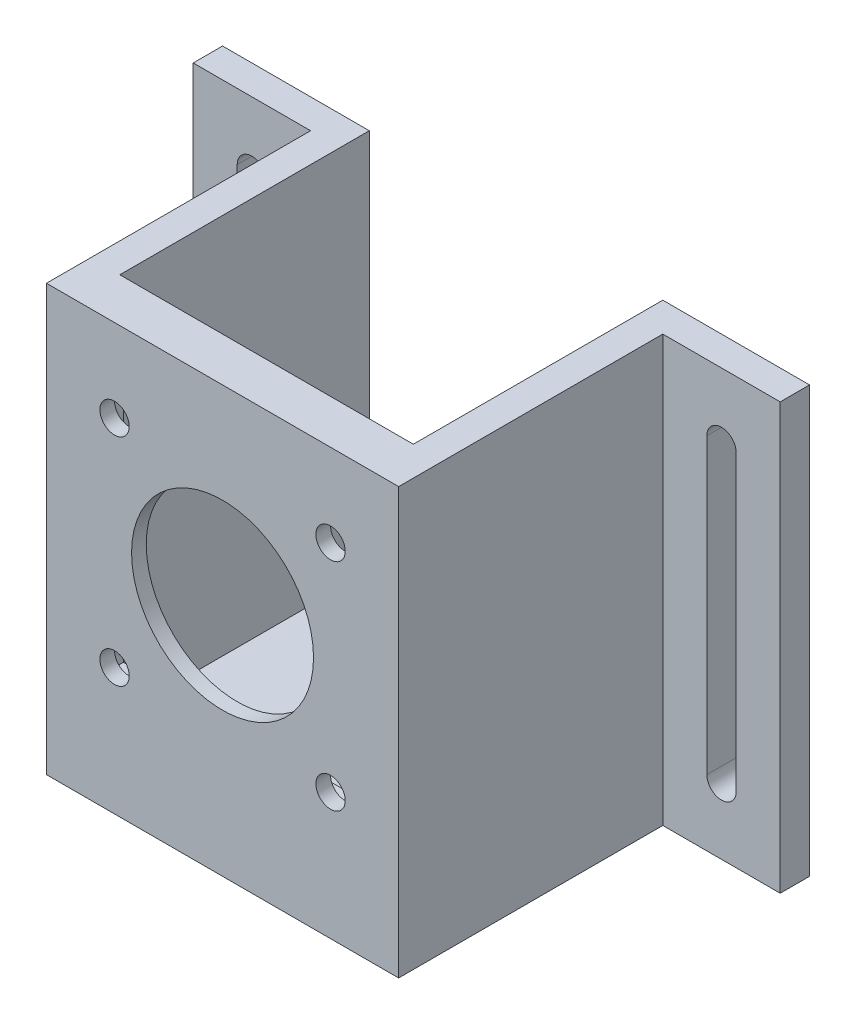
ISO-10303-21;
HEADER;
FILE_DESCRIPTION(('STEP AP214'),'2;1');
FILE_NAME('part.step','',(''),(''),'','','');
FILE_SCHEMA(('AUTOMOTIVE_DESIGN { 1 0 10303 214 1 1 1 1 }'));
ENDSEC;
DATA;
#1=APPLICATION_CONTEXT('core data for automotive mechanical design processes');
#2=APPLICATION_PROTOCOL_DEFINITION('international standard','automotive_design',2000,#1);
#3=PRODUCT_CONTEXT('',#1,'mechanical');
#4=PRODUCT('Part','Part','',(#3));
#5=PRODUCT_RELATED_PRODUCT_CATEGORY('part','',(#4));
#6=PRODUCT_DEFINITION_FORMATION('','',#4);
#7=PRODUCT_DEFINITION_CONTEXT('part definition',#1,'design');
#8=PRODUCT_DEFINITION('design','',#6,#7);
#9=PRODUCT_DEFINITION_SHAPE('','',#8);
#10=(LENGTH_UNIT() NAMED_UNIT(*) SI_UNIT(.MILLI.,.METRE.));
#11=(NAMED_UNIT(*) PLANE_ANGLE_UNIT() SI_UNIT($,.RADIAN.));
#12=(NAMED_UNIT(*) SI_UNIT($,.STERADIAN.) SOLID_ANGLE_UNIT());
#13=UNCERTAINTY_MEASURE_WITH_UNIT(LENGTH_MEASURE(1.E-05),#10,'distance_accuracy_value','');
#14=(GEOMETRIC_REPRESENTATION_CONTEXT(3) GLOBAL_UNCERTAINTY_ASSIGNED_CONTEXT((#13)) GLOBAL_UNIT_ASSIGNED_CONTEXT((#10,
#11,#12)) REPRESENTATION_CONTEXT('',''));
#15=CARTESIAN_POINT('',(0.,0.,0.));
#16=DIRECTION('',(0.,0.,1.));
#17=DIRECTION('',(1.,0.,0.));
#18=AXIS2_PLACEMENT_3D('',#15,#16,#17);
#19=CARTESIAN_POINT('',(76.2,9.525,0.));
#20=DIRECTION('',(-1.,0.,0.));
#21=DIRECTION('',(0.,0.,1.));
#22=AXIS2_PLACEMENT_3D('',#19,#20,#21);
#23=PLANE('',#22);
#24=DIRECTION('',(0.,-1.,0.));
#25=VECTOR('',#24,1.);
#26=CARTESIAN_POINT('',(76.2,0.,-57.15));
#27=LINE('',#26,#25);
#28=CARTESIAN_POINT('',(76.2,92.075,-57.15));
#29=VERTEX_POINT('',#28);
#30=CARTESIAN_POINT('',(76.2,0.,-57.15));
#31=VERTEX_POINT('',#30);
#32=EDGE_CURVE('E250',#29,#31,#27,.T.);
#33=ORIENTED_EDGE('',*,*,#32,.F.);
#34=DIRECTION('',(0.,0.,-1.));
#35=VECTOR('',#34,1.);
#36=CARTESIAN_POINT('',(76.2,92.075,0.));
#37=LINE('',#36,#35);
#38=CARTESIAN_POINT('',(76.2,92.075,0.));
#39=VERTEX_POINT('',#38);
#40=EDGE_CURVE('E470',#39,#29,#37,.T.);
#41=ORIENTED_EDGE('',*,*,#40,.F.);
#42=DIRECTION('',(0.,-1.,0.));
#43=VECTOR('',#42,1.);
#44=CARTESIAN_POINT('',(76.2,9.525,0.));
#45=LINE('',#44,#43);
#46=CARTESIAN_POINT('',(76.2,0.,0.));
#47=VERTEX_POINT('',#46);
#48=EDGE_CURVE('E49',#39,#47,#45,.T.);
#49=ORIENTED_EDGE('',*,*,#48,.T.);
#50=DIRECTION('',(0.,0.,-1.));
#51=VECTOR('',#50,1.);
#52=CARTESIAN_POINT('',(76.2,0.,0.));
#53=LINE('',#52,#51);
#54=EDGE_CURVE('E492',#47,#31,#53,.T.);
#55=ORIENTED_EDGE('',*,*,#54,.T.);
#56=EDGE_LOOP('',(#33,#41,#49,#55));
#57=FACE_BOUND('',#56,.T.);
#58=ADVANCED_FACE('F39',(#57),#23,.F.);
#59=CARTESIAN_POINT('',(0.,9.525,0.));
#60=DIRECTION('',(1.,0.,0.));
#61=DIRECTION('',(0.,0.,-1.));
#62=AXIS2_PLACEMENT_3D('',#59,#60,#61);
#63=PLANE('',#62);
#64=DIRECTION('',(0.,1.,0.));
#65=VECTOR('',#64,1.);
#66=CARTESIAN_POINT('',(0.,92.075,-57.15));
#67=LINE('',#66,#65);
#68=CARTESIAN_POINT('',(0.,0.,-57.15));
#69=VERTEX_POINT('',#68);
#70=CARTESIAN_POINT('',(0.,92.075,-57.15));
#71=VERTEX_POINT('',#70);
#72=EDGE_CURVE('E322',#69,#71,#67,.T.);
#73=ORIENTED_EDGE('',*,*,#72,.F.);
#74=DIRECTION('',(0.,0.,1.));
#75=VECTOR('',#74,1.);
#76=CARTESIAN_POINT('',(0.,0.,0.));
#77=LINE('',#76,#75);
#78=CARTESIAN_POINT('',(0.,0.,0.));
#79=VERTEX_POINT('',#78);
#80=EDGE_CURVE('E478',#69,#79,#77,.T.);
#81=ORIENTED_EDGE('',*,*,#80,.T.);
#82=DIRECTION('',(0.,-1.,0.));
#83=VECTOR('',#82,1.);
#84=CARTESIAN_POINT('',(0.,9.525,0.));
#85=LINE('',#84,#83);
#86=CARTESIAN_POINT('',(0.,92.075,0.));
#87=VERTEX_POINT('',#86);
#88=EDGE_CURVE('E11',#87,#79,#85,.T.);
#89=ORIENTED_EDGE('',*,*,#88,.F.);
#90=DIRECTION('',(0.,0.,1.));
#91=VECTOR('',#90,1.);
#92=CARTESIAN_POINT('',(0.,92.075,0.));
#93=LINE('',#92,#91);
#94=EDGE_CURVE('E463',#71,#87,#93,.T.);
#95=ORIENTED_EDGE('',*,*,#94,.F.);
#96=EDGE_LOOP('',(#73,#81,#89,#95));
#97=FACE_BOUND('',#96,.T.);
#98=ADVANCED_FACE('F41',(#97),#63,.F.);
#99=CARTESIAN_POINT('',(0.,9.525,0.));
#100=DIRECTION('',(0.,-1.,0.));
#101=DIRECTION('',(0.,0.,-1.));
#102=AXIS2_PLACEMENT_3D('',#99,#100,#101);
#103=PLANE('',#102);
#104=DIRECTION('',(0.,0.,-1.));
#105=VECTOR('',#104,1.);
#106=CARTESIAN_POINT('',(6.35,9.525,-9.525));
#107=LINE('',#106,#105);
#108=CARTESIAN_POINT('',(6.35,9.525,-9.525));
#109=VERTEX_POINT('',#108);
#110=CARTESIAN_POINT('',(6.35,9.525,-63.5));
#111=VERTEX_POINT('',#110);
#112=EDGE_CURVE('E348',#109,#111,#107,.T.);
#113=ORIENTED_EDGE('',*,*,#112,.F.);
#114=DIRECTION('',(-1.,0.,0.));
#115=VECTOR('',#114,1.);
#116=CARTESIAN_POINT('',(0.,9.525,-9.525));
#117=LINE('',#116,#115);
#118=CARTESIAN_POINT('',(69.85,9.525,-9.525));
#119=VERTEX_POINT('',#118);
#120=EDGE_CURVE('E462',#119,#109,#117,.T.);
#121=ORIENTED_EDGE('',*,*,#120,.F.);
#122=DIRECTION('',(0.,0.,1.));
#123=VECTOR('',#122,1.);
#124=CARTESIAN_POINT('',(69.85,9.525,-9.525));
#125=LINE('',#124,#123);
#126=CARTESIAN_POINT('',(69.85,9.525,-63.5));
#127=VERTEX_POINT('',#126);
#128=EDGE_CURVE('E352',#127,#119,#125,.T.);
#129=ORIENTED_EDGE('',*,*,#128,.F.);
#130=DIRECTION('',(-1.,0.,0.));
#131=VECTOR('',#130,1.);
#132=CARTESIAN_POINT('',(0.,9.525,-63.5));
#133=LINE('',#132,#131);
#134=EDGE_CURVE('E482',#127,#111,#133,.T.);
#135=ORIENTED_EDGE('',*,*,#134,.T.);
#136=EDGE_LOOP('',(#113,#121,#129,#135));
#137=FACE_BOUND('',#136,.T.);
#138=ADVANCED_FACE('F548',(#137),#103,.F.);
#139=CARTESIAN_POINT('',(0.,92.075,-9.525));
#140=DIRECTION('',(0.,0.,1.));
#141=DIRECTION('',(1.,0.,0.));
#142=AXIS2_PLACEMENT_3D('',#139,#140,#141);
#143=PLANE('',#142);
#144=DIRECTION('',(1.,0.,0.));
#145=VECTOR('',#144,1.);
#146=CARTESIAN_POINT('',(69.0607433991601,81.7422937134878,-9.525));
#147=LINE('',#146,#145);
#148=CARTESIAN_POINT('',(7.13925660083996,81.7422937134878,-9.525));
#149=VERTEX_POINT('',#148);
#150=CARTESIAN_POINT('',(69.0607433991601,81.7422937134878,-9.525));
#151=VERTEX_POINT('',#150);
#152=EDGE_CURVE('E403',#149,#151,#147,.T.);
#153=ORIENTED_EDGE('',*,*,#152,.F.);
#154=DIRECTION('',(0.,1.,0.));
#155=VECTOR('',#154,1.);
#156=CARTESIAN_POINT('',(7.13925660083996,81.7422937134878,-9.525));
#157=LINE('',#156,#155);
#158=CARTESIAN_POINT('',(7.13925660083996,19.8577062865122,-9.525));
#159=VERTEX_POINT('',#158);
#160=EDGE_CURVE('E374',#159,#149,#157,.T.);
#161=ORIENTED_EDGE('',*,*,#160,.F.);
#162=DIRECTION('',(-1.,0.,0.));
#163=VECTOR('',#162,1.);
#164=CARTESIAN_POINT('',(69.06074339916,19.8577062865122,-9.525));
#165=LINE('',#164,#163);
#166=CARTESIAN_POINT('',(69.06074339916,19.8577062865122,-9.525));
#167=VERTEX_POINT('',#166);
#168=EDGE_CURVE('E388',#167,#159,#165,.T.);
#169=ORIENTED_EDGE('',*,*,#168,.F.);
#170=DIRECTION('',(0.,-1.,0.));
#171=VECTOR('',#170,1.);
#172=CARTESIAN_POINT('',(69.0607433991601,81.7422937134878,-9.525));
#173=LINE('',#172,#171);
#174=EDGE_CURVE('E407',#151,#167,#173,.T.);
#175=ORIENTED_EDGE('',*,*,#174,.F.);
#176=EDGE_LOOP('',(#153,#161,#169,#175));
#177=FACE_BOUND('',#176,.T.);
#178=DIRECTION('',(0.,-1.,0.));
#179=VECTOR('',#178,1.);
#180=CARTESIAN_POINT('',(6.35,146.42224579038,-9.525));
#181=LINE('',#180,#179);
#182=CARTESIAN_POINT('',(6.35,92.075,-9.525));
#183=VERTEX_POINT('',#182);
#184=EDGE_CURVE('E360',#183,#109,#181,.T.);
#185=ORIENTED_EDGE('',*,*,#184,.F.);
#186=DIRECTION('',(-1.,0.,0.));
#187=VECTOR('',#186,1.);
#188=CARTESIAN_POINT('',(0.,92.075,-9.525));
#189=LINE('',#188,#187);
#190=CARTESIAN_POINT('',(69.85,92.075,-9.525));
#191=VERTEX_POINT('',#190);
#192=EDGE_CURVE('E474',#191,#183,#189,.T.);
#193=ORIENTED_EDGE('',*,*,#192,.F.);
#194=DIRECTION('',(0.,-1.,0.));
#195=VECTOR('',#194,1.);
#196=CARTESIAN_POINT('',(69.85,146.42224579038,-9.525));
#197=LINE('',#196,#195);
#198=EDGE_CURVE('E377',#191,#119,#197,.T.);
#199=ORIENTED_EDGE('',*,*,#198,.T.);
#200=ORIENTED_EDGE('',*,*,#120,.T.);
#201=EDGE_LOOP('',(#185,#193,#199,#200));
#202=FACE_BOUND('',#201,.T.);
#203=ADVANCED_FACE('F541',(#177,#202),#143,.F.);
#204=CARTESIAN_POINT('',(38.1,50.8,0.));
#205=DIRECTION('',(0.,0.,-1.));
#206=DIRECTION('',(-1.,0.,0.));
#207=AXIS2_PLACEMENT_3D('',#204,#205,#206);
#208=CYLINDRICAL_SURFACE('',#207,19.685);
#209=CARTESIAN_POINT('',(38.1,50.8,0.));
#210=DIRECTION('',(0.,0.,-1.));
#211=DIRECTION('',(-1.,0.,0.));
#212=AXIS2_PLACEMENT_3D('',#209,#210,#211);
#213=CIRCLE('',#212,19.685);
#214=CARTESIAN_POINT('',(18.415,50.8,0.));
#215=VERTEX_POINT('',#214);
#216=EDGE_CURVE('E447',#215,#215,#213,.T.);
#217=ORIENTED_EDGE('',*,*,#216,.F.);
#218=EDGE_LOOP('',(#217));
#219=FACE_BOUND('',#218,.T.);
#220=CARTESIAN_POINT('',(38.1,50.8,-3.175));
#221=DIRECTION('',(0.,0.,-1.));
#222=DIRECTION('',(-1.,0.,0.));
#223=AXIS2_PLACEMENT_3D('',#220,#221,#222);
#224=CIRCLE('',#223,19.685);
#225=CARTESIAN_POINT('',(18.415,50.8,-3.175));
#226=VERTEX_POINT('',#225);
#227=EDGE_CURVE('E438',#226,#226,#224,.F.);
#228=ORIENTED_EDGE('',*,*,#227,.F.);
#229=EDGE_LOOP('',(#228));
#230=FACE_BOUND('',#229,.T.);
#231=ADVANCED_FACE('F590',(#219,#230),#208,.F.);
#232=CARTESIAN_POINT('',(14.732,27.432,0.));
#233=DIRECTION('',(0.,0.,-1.));
#234=DIRECTION('',(-1.,0.,0.));
#235=AXIS2_PLACEMENT_3D('',#232,#233,#234);
#236=CYLINDRICAL_SURFACE('',#235,3.175);
#237=CARTESIAN_POINT('',(14.732,27.432,0.));
#238=DIRECTION('',(0.,0.,-1.));
#239=DIRECTION('',(1.,0.,0.));
#240=AXIS2_PLACEMENT_3D('',#237,#238,#239);
#241=CIRCLE('',#240,3.175);
#242=CARTESIAN_POINT('',(17.907,27.432,0.));
#243=VERTEX_POINT('',#242);
#244=EDGE_CURVE('E443',#243,#243,#241,.T.);
#245=ORIENTED_EDGE('',*,*,#244,.F.);
#246=EDGE_LOOP('',(#245));
#247=FACE_BOUND('',#246,.T.);
#248=CARTESIAN_POINT('',(14.732,27.432,-3.175));
#249=DIRECTION('',(0.,0.,-1.));
#250=DIRECTION('',(-1.,0.,0.));
#251=AXIS2_PLACEMENT_3D('',#248,#249,#250);
#252=CIRCLE('',#251,3.175);
#253=CARTESIAN_POINT('',(11.557,27.432,-3.175));
#254=VERTEX_POINT('',#253);
#255=EDGE_CURVE('E434',#254,#254,#252,.F.);
#256=ORIENTED_EDGE('',*,*,#255,.F.);
#257=EDGE_LOOP('',(#256));
#258=FACE_BOUND('',#257,.T.);
#259=ADVANCED_FACE('F593',(#247,#258),#236,.F.);
#260=CARTESIAN_POINT('',(61.468,27.432,0.));
#261=DIRECTION('',(0.,0.,-1.));
#262=DIRECTION('',(-1.,0.,0.));
#263=AXIS2_PLACEMENT_3D('',#260,#261,#262);
#264=CYLINDRICAL_SURFACE('',#263,3.175);
#265=CARTESIAN_POINT('',(61.468,27.432,0.));
#266=DIRECTION('',(0.,0.,-1.));
#267=DIRECTION('',(1.,0.,0.));
#268=AXIS2_PLACEMENT_3D('',#265,#266,#267);
#269=CIRCLE('',#268,3.175);
#270=CARTESIAN_POINT('',(64.643,27.432,0.));
#271=VERTEX_POINT('',#270);
#272=EDGE_CURVE('E448',#271,#271,#269,.T.);
#273=ORIENTED_EDGE('',*,*,#272,.F.);
#274=EDGE_LOOP('',(#273));
#275=FACE_BOUND('',#274,.T.);
#276=CARTESIAN_POINT('',(61.468,27.432,-3.175));
#277=DIRECTION('',(0.,0.,-1.));
#278=DIRECTION('',(-1.,0.,0.));
#279=AXIS2_PLACEMENT_3D('',#276,#277,#278);
#280=CIRCLE('',#279,3.175);
#281=CARTESIAN_POINT('',(58.293,27.432,-3.175));
#282=VERTEX_POINT('',#281);
#283=EDGE_CURVE('E430',#282,#282,#280,.F.);
#284=ORIENTED_EDGE('',*,*,#283,.F.);
#285=EDGE_LOOP('',(#284));
#286=FACE_BOUND('',#285,.T.);
#287=ADVANCED_FACE('F619',(#275,#286),#264,.F.);
#288=CARTESIAN_POINT('',(61.468,74.168,0.));
#289=DIRECTION('',(0.,0.,-1.));
#290=DIRECTION('',(-1.,0.,0.));
#291=AXIS2_PLACEMENT_3D('',#288,#289,#290);
#292=CYLINDRICAL_SURFACE('',#291,3.175);
#293=CARTESIAN_POINT('',(61.468,74.168,0.));
#294=DIRECTION('',(0.,0.,-1.));
#295=DIRECTION('',(-1.,0.,0.));
#296=AXIS2_PLACEMENT_3D('',#293,#294,#295);
#297=CIRCLE('',#296,3.175);
#298=CARTESIAN_POINT('',(58.293,74.168,0.));
#299=VERTEX_POINT('',#298);
#300=EDGE_CURVE('E452',#299,#299,#297,.T.);
#301=ORIENTED_EDGE('',*,*,#300,.F.);
#302=EDGE_LOOP('',(#301));
#303=FACE_BOUND('',#302,.T.);
#304=CARTESIAN_POINT('',(61.468,74.168,-3.175));
#305=DIRECTION('',(0.,0.,-1.));
#306=DIRECTION('',(-1.,0.,0.));
#307=AXIS2_PLACEMENT_3D('',#304,#305,#306);
#308=CIRCLE('',#307,3.175);
#309=CARTESIAN_POINT('',(58.293,74.168,-3.175));
#310=VERTEX_POINT('',#309);
#311=EDGE_CURVE('E426',#310,#310,#308,.F.);
#312=ORIENTED_EDGE('',*,*,#311,.F.);
#313=EDGE_LOOP('',(#312));
#314=FACE_BOUND('',#313,.T.);
#315=ADVANCED_FACE('F577',(#303,#314),#292,.F.);
#316=CARTESIAN_POINT('',(14.732,74.168,0.));
#317=DIRECTION('',(0.,0.,-1.));
#318=DIRECTION('',(-1.,0.,0.));
#319=AXIS2_PLACEMENT_3D('',#316,#317,#318);
#320=CYLINDRICAL_SURFACE('',#319,3.175);
#321=CARTESIAN_POINT('',(14.732,74.168,0.));
#322=DIRECTION('',(0.,0.,-1.));
#323=DIRECTION('',(-1.,0.,0.));
#324=AXIS2_PLACEMENT_3D('',#321,#322,#323);
#325=CIRCLE('',#324,3.175);
#326=CARTESIAN_POINT('',(11.557,74.168,0.));
#327=VERTEX_POINT('',#326);
#328=EDGE_CURVE('E442',#327,#327,#325,.T.);
#329=ORIENTED_EDGE('',*,*,#328,.F.);
#330=EDGE_LOOP('',(#329));
#331=FACE_BOUND('',#330,.T.);
#332=CARTESIAN_POINT('',(14.732,74.168,-3.175));
#333=DIRECTION('',(0.,0.,-1.));
#334=DIRECTION('',(-1.,0.,0.));
#335=AXIS2_PLACEMENT_3D('',#332,#333,#334);
#336=CIRCLE('',#335,3.175);
#337=CARTESIAN_POINT('',(11.557,74.168,-3.175));
#338=VERTEX_POINT('',#337);
#339=EDGE_CURVE('E43',#338,#338,#336,.F.);
#340=ORIENTED_EDGE('',*,*,#339,.F.);
#341=EDGE_LOOP('',(#340));
#342=FACE_BOUND('',#341,.T.);
#343=ADVANCED_FACE('F571',(#331,#342),#320,.F.);
#344=CARTESIAN_POINT('',(0.,9.525,0.));
#345=DIRECTION('',(0.,0.,-1.));
#346=DIRECTION('',(-1.,0.,0.));
#347=AXIS2_PLACEMENT_3D('',#344,#345,#346);
#348=PLANE('',#347);
#349=ORIENTED_EDGE('',*,*,#328,.T.);
#350=EDGE_LOOP('',(#349));
#351=FACE_BOUND('',#350,.T.);
#352=ORIENTED_EDGE('',*,*,#300,.T.);
#353=EDGE_LOOP('',(#352));
#354=FACE_BOUND('',#353,.T.);
#355=ORIENTED_EDGE('',*,*,#272,.T.);
#356=EDGE_LOOP('',(#355));
#357=FACE_BOUND('',#356,.T.);
#358=ORIENTED_EDGE('',*,*,#244,.T.);
#359=EDGE_LOOP('',(#358));
#360=FACE_BOUND('',#359,.T.);
#361=ORIENTED_EDGE('',*,*,#216,.T.);
#362=EDGE_LOOP('',(#361));
#363=FACE_BOUND('',#362,.T.);
#364=DIRECTION('',(1.,0.,0.));
#365=VECTOR('',#364,1.);
#366=CARTESIAN_POINT('',(0.,0.,0.));
#367=LINE('',#366,#365);
#368=EDGE_CURVE('E489',#79,#47,#367,.T.);
#369=ORIENTED_EDGE('',*,*,#368,.T.);
#370=ORIENTED_EDGE('',*,*,#48,.F.);
#371=DIRECTION('',(1.,0.,0.));
#372=VECTOR('',#371,1.);
#373=CARTESIAN_POINT('',(0.,92.075,0.));
#374=LINE('',#373,#372);
#375=EDGE_CURVE('E466',#87,#39,#374,.T.);
#376=ORIENTED_EDGE('',*,*,#375,.F.);
#377=ORIENTED_EDGE('',*,*,#88,.T.);
#378=EDGE_LOOP('',(#369,#370,#376,#377));
#379=FACE_BOUND('',#378,.T.);
#380=ADVANCED_FACE('F518',(#351,#354,#357,#360,#363,#379),#348,.F.);
#381=CARTESIAN_POINT('',(0.,9.525,-63.5));
#382=DIRECTION('',(0.,0.,1.));
#383=DIRECTION('',(1.,0.,0.));
#384=AXIS2_PLACEMENT_3D('',#381,#382,#383);
#385=PLANE('',#384);
#386=DIRECTION('',(0.,1.,0.));
#387=VECTOR('',#386,1.);
#388=CARTESIAN_POINT('',(-9.525,77.7875,-63.5));
#389=LINE('',#388,#387);
#390=CARTESIAN_POINT('',(-9.525,14.2875,-63.5));
#391=VERTEX_POINT('',#390);
#392=CARTESIAN_POINT('',(-9.525,77.7875,-63.5));
#393=VERTEX_POINT('',#392);
#394=EDGE_CURVE('E215',#391,#393,#389,.T.);
#395=ORIENTED_EDGE('',*,*,#394,.T.);
#396=CARTESIAN_POINT('',(-12.7,77.7875,-63.5));
#397=DIRECTION('',(0.,0.,1.));
#398=DIRECTION('',(1.,0.,0.));
#399=AXIS2_PLACEMENT_3D('',#396,#397,#398);
#400=CIRCLE('',#399,3.175);
#401=CARTESIAN_POINT('',(-15.875,77.7875,-63.5));
#402=VERTEX_POINT('',#401);
#403=EDGE_CURVE('E206',#393,#402,#400,.T.);
#404=ORIENTED_EDGE('',*,*,#403,.T.);
#405=DIRECTION('',(0.,-1.,0.));
#406=VECTOR('',#405,1.);
#407=CARTESIAN_POINT('',(-15.875,77.7875,-63.5));
#408=LINE('',#407,#406);
#409=CARTESIAN_POINT('',(-15.875,14.2875,-63.5));
#410=VERTEX_POINT('',#409);
#411=EDGE_CURVE('E218',#402,#410,#408,.T.);
#412=ORIENTED_EDGE('',*,*,#411,.T.);
#413=CARTESIAN_POINT('',(-12.7,14.2875,-63.5));
#414=DIRECTION('',(0.,0.,1.));
#415=DIRECTION('',(1.,0.,0.));
#416=AXIS2_PLACEMENT_3D('',#413,#414,#415);
#417=CIRCLE('',#416,3.175);
#418=EDGE_CURVE('E56',#410,#391,#417,.T.);
#419=ORIENTED_EDGE('',*,*,#418,.T.);
#420=EDGE_LOOP('',(#395,#404,#412,#419));
#421=FACE_BOUND('',#420,.T.);
#422=DIRECTION('',(0.,-1.,0.));
#423=VECTOR('',#422,1.);
#424=CARTESIAN_POINT('',(85.725,14.2875,-63.5));
#425=LINE('',#424,#423);
#426=CARTESIAN_POINT('',(85.725,77.7875,-63.5));
#427=VERTEX_POINT('',#426);
#428=CARTESIAN_POINT('',(85.725,14.2875,-63.5));
#429=VERTEX_POINT('',#428);
#430=EDGE_CURVE('E267',#427,#429,#425,.T.);
#431=ORIENTED_EDGE('',*,*,#430,.T.);
#432=CARTESIAN_POINT('',(88.9,14.2875,-63.5));
#433=DIRECTION('',(0.,0.,1.));
#434=DIRECTION('',(-1.,0.,0.));
#435=AXIS2_PLACEMENT_3D('',#432,#433,#434);
#436=CIRCLE('',#435,3.175);
#437=CARTESIAN_POINT('',(92.075,14.2875,-63.5));
#438=VERTEX_POINT('',#437);
#439=EDGE_CURVE('E256',#429,#438,#436,.T.);
#440=ORIENTED_EDGE('',*,*,#439,.T.);
#441=DIRECTION('',(0.,1.,0.));
#442=VECTOR('',#441,1.);
#443=CARTESIAN_POINT('',(92.075,77.7875,-63.5));
#444=LINE('',#443,#442);
#445=CARTESIAN_POINT('',(92.075,77.7875,-63.5));
#446=VERTEX_POINT('',#445);
#447=EDGE_CURVE('E260',#438,#446,#444,.T.);
#448=ORIENTED_EDGE('',*,*,#447,.T.);
#449=CARTESIAN_POINT('',(88.9,77.7875,-63.5));
#450=DIRECTION('',(0.,0.,1.));
#451=DIRECTION('',(1.,0.,0.));
#452=AXIS2_PLACEMENT_3D('',#449,#450,#451);
#453=CIRCLE('',#452,3.175);
#454=EDGE_CURVE('E64',#446,#427,#453,.T.);
#455=ORIENTED_EDGE('',*,*,#454,.T.);
#456=EDGE_LOOP('',(#431,#440,#448,#455));
#457=FACE_BOUND('',#456,.T.);
#458=DIRECTION('',(-1.,0.,0.));
#459=VECTOR('',#458,1.);
#460=CARTESIAN_POINT('',(0.,0.,-63.5));
#461=LINE('',#460,#459);
#462=CARTESIAN_POINT('',(101.6,0.,-63.5));
#463=VERTEX_POINT('',#462);
#464=CARTESIAN_POINT('',(-25.4,0.,-63.5));
#465=VERTEX_POINT('',#464);
#466=EDGE_CURVE('E486',#463,#465,#461,.T.);
#467=ORIENTED_EDGE('',*,*,#466,.T.);
#468=DIRECTION('',(0.,-1.,0.));
#469=VECTOR('',#468,1.);
#470=CARTESIAN_POINT('',(-25.4,92.075,-63.5));
#471=LINE('',#470,#469);
#472=CARTESIAN_POINT('',(-25.4,92.075,-63.5));
#473=VERTEX_POINT('',#472);
#474=EDGE_CURVE('E323',#473,#465,#471,.T.);
#475=ORIENTED_EDGE('',*,*,#474,.F.);
#476=DIRECTION('',(1.,0.,0.));
#477=VECTOR('',#476,1.);
#478=CARTESIAN_POINT('',(0.,92.075,-63.5));
#479=LINE('',#478,#477);
#480=CARTESIAN_POINT('',(6.35,92.075,-63.5));
#481=VERTEX_POINT('',#480);
#482=EDGE_CURVE('E353',#473,#481,#479,.T.);
#483=ORIENTED_EDGE('',*,*,#482,.T.);
#484=DIRECTION('',(0.,-1.,0.));
#485=VECTOR('',#484,1.);
#486=CARTESIAN_POINT('',(6.35,146.42224579038,-63.5));
#487=LINE('',#486,#485);
#488=EDGE_CURVE('E357',#481,#111,#487,.T.);
#489=ORIENTED_EDGE('',*,*,#488,.T.);
#490=ORIENTED_EDGE('',*,*,#134,.F.);
#491=DIRECTION('',(0.,-1.,0.));
#492=VECTOR('',#491,1.);
#493=CARTESIAN_POINT('',(69.85,146.42224579038,-63.5));
#494=LINE('',#493,#492);
#495=CARTESIAN_POINT('',(69.85,92.075,-63.5));
#496=VERTEX_POINT('',#495);
#497=EDGE_CURVE('E371',#496,#127,#494,.T.);
#498=ORIENTED_EDGE('',*,*,#497,.F.);
#499=DIRECTION('',(1.,0.,0.));
#500=VECTOR('',#499,1.);
#501=CARTESIAN_POINT('',(76.2,92.075,-63.5));
#502=LINE('',#501,#500);
#503=CARTESIAN_POINT('',(101.6,92.075,-63.5));
#504=VERTEX_POINT('',#503);
#505=EDGE_CURVE('E370',#496,#504,#502,.T.);
#506=ORIENTED_EDGE('',*,*,#505,.T.);
#507=DIRECTION('',(0.,1.,0.));
#508=VECTOR('',#507,1.);
#509=CARTESIAN_POINT('',(101.6,0.,-63.5));
#510=LINE('',#509,#508);
#511=EDGE_CURVE('E297',#463,#504,#510,.T.);
#512=ORIENTED_EDGE('',*,*,#511,.F.);
#513=EDGE_LOOP('',(#467,#475,#483,#489,#490,#498,#506,#512));
#514=FACE_BOUND('',#513,.T.);
#515=ADVANCED_FACE('F223',(#421,#457,#514),#385,.F.);
#516=CARTESIAN_POINT('',(0.,0.,0.));
#517=DIRECTION('',(0.,-1.,0.));
#518=DIRECTION('',(0.,0.,-1.));
#519=AXIS2_PLACEMENT_3D('',#516,#517,#518);
#520=PLANE('',#519);
#521=ORIENTED_EDGE('',*,*,#80,.F.);
#522=DIRECTION('',(1.,0.,0.));
#523=VECTOR('',#522,1.);
#524=CARTESIAN_POINT('',(-25.4,0.,-57.15));
#525=LINE('',#524,#523);
#526=CARTESIAN_POINT('',(-25.4,0.,-57.15));
#527=VERTEX_POINT('',#526);
#528=EDGE_CURVE('E344',#527,#69,#525,.T.);
#529=ORIENTED_EDGE('',*,*,#528,.F.);
#530=DIRECTION('',(0.,0.,1.));
#531=VECTOR('',#530,1.);
#532=CARTESIAN_POINT('',(-25.4,0.,-63.5));
#533=LINE('',#532,#531);
#534=EDGE_CURVE('E327',#465,#527,#533,.T.);
#535=ORIENTED_EDGE('',*,*,#534,.F.);
#536=ORIENTED_EDGE('',*,*,#466,.F.);
#537=DIRECTION('',(0.,0.,-1.));
#538=VECTOR('',#537,1.);
#539=CARTESIAN_POINT('',(101.6,0.,-63.5));
#540=LINE('',#539,#538);
#541=CARTESIAN_POINT('',(101.6,0.,-57.15));
#542=VERTEX_POINT('',#541);
#543=EDGE_CURVE('E307',#542,#463,#540,.T.);
#544=ORIENTED_EDGE('',*,*,#543,.F.);
#545=DIRECTION('',(-1.,0.,0.));
#546=VECTOR('',#545,1.);
#547=CARTESIAN_POINT('',(101.6,0.,-57.15));
#548=LINE('',#547,#546);
#549=EDGE_CURVE('E311',#542,#31,#548,.T.);
#550=ORIENTED_EDGE('',*,*,#549,.T.);
#551=ORIENTED_EDGE('',*,*,#54,.F.);
#552=ORIENTED_EDGE('',*,*,#368,.F.);
#553=EDGE_LOOP('',(#521,#529,#535,#536,#544,#550,#551,#552));
#554=FACE_BOUND('',#553,.T.);
#555=ADVANCED_FACE('F507',(#554),#520,.T.);
#556=CARTESIAN_POINT('',(0.,92.075,0.));
#557=DIRECTION('',(0.,-1.,0.));
#558=DIRECTION('',(0.,0.,-1.));
#559=AXIS2_PLACEMENT_3D('',#556,#557,#558);
#560=PLANE('',#559);
#561=ORIENTED_EDGE('',*,*,#482,.F.);
#562=DIRECTION('',(0.,0.,-1.));
#563=VECTOR('',#562,1.);
#564=CARTESIAN_POINT('',(-25.4,92.075,-63.5));
#565=LINE('',#564,#563);
#566=CARTESIAN_POINT('',(-25.4,92.075,-57.15));
#567=VERTEX_POINT('',#566);
#568=EDGE_CURVE('E333',#567,#473,#565,.T.);
#569=ORIENTED_EDGE('',*,*,#568,.F.);
#570=DIRECTION('',(1.,0.,0.));
#571=VECTOR('',#570,1.);
#572=CARTESIAN_POINT('',(-25.4,92.075,-57.15));
#573=LINE('',#572,#571);
#574=EDGE_CURVE('E337',#567,#71,#573,.T.);
#575=ORIENTED_EDGE('',*,*,#574,.T.);
#576=ORIENTED_EDGE('',*,*,#94,.T.);
#577=ORIENTED_EDGE('',*,*,#375,.T.);
#578=ORIENTED_EDGE('',*,*,#40,.T.);
#579=DIRECTION('',(-1.,0.,0.));
#580=VECTOR('',#579,1.);
#581=CARTESIAN_POINT('',(101.6,92.075,-57.15));
#582=LINE('',#581,#580);
#583=CARTESIAN_POINT('',(101.6,92.075,-57.15));
#584=VERTEX_POINT('',#583);
#585=EDGE_CURVE('E318',#584,#29,#582,.T.);
#586=ORIENTED_EDGE('',*,*,#585,.F.);
#587=DIRECTION('',(0.,0.,1.));
#588=VECTOR('',#587,1.);
#589=CARTESIAN_POINT('',(101.6,92.075,-63.5));
#590=LINE('',#589,#588);
#591=EDGE_CURVE('E301',#504,#584,#590,.T.);
#592=ORIENTED_EDGE('',*,*,#591,.F.);
#593=ORIENTED_EDGE('',*,*,#505,.F.);
#594=DIRECTION('',(0.,0.,-1.));
#595=VECTOR('',#594,1.);
#596=CARTESIAN_POINT('',(69.85,92.075,-9.525));
#597=LINE('',#596,#595);
#598=EDGE_CURVE('E366',#191,#496,#597,.T.);
#599=ORIENTED_EDGE('',*,*,#598,.F.);
#600=ORIENTED_EDGE('',*,*,#192,.T.);
#601=DIRECTION('',(0.,0.,1.));
#602=VECTOR('',#601,1.);
#603=CARTESIAN_POINT('',(6.35,92.075,-9.525));
#604=LINE('',#603,#602);
#605=EDGE_CURVE('E349',#481,#183,#604,.T.);
#606=ORIENTED_EDGE('',*,*,#605,.F.);
#607=EDGE_LOOP('',(#561,#569,#575,#576,#577,#578,#586,#592,#593,#599,#600,#606));
#608=FACE_BOUND('',#607,.T.);
#609=ADVANCED_FACE('F515',(#608),#560,.F.);
#610=CARTESIAN_POINT('',(0.,0.,-3.175));
#611=DIRECTION('',(0.,0.,-1.));
#612=DIRECTION('',(-1.,0.,0.));
#613=AXIS2_PLACEMENT_3D('',#610,#611,#612);
#614=PLANE('',#613);
#615=DIRECTION('',(0.,1.,0.));
#616=VECTOR('',#615,1.);
#617=CARTESIAN_POINT('',(7.13925660083996,81.7422937134878,-3.175));
#618=LINE('',#617,#616);
#619=CARTESIAN_POINT('',(7.13925660083996,19.8577062865122,-3.175));
#620=VERTEX_POINT('',#619);
#621=CARTESIAN_POINT('',(7.13925660083996,81.7422937134878,-3.175));
#622=VERTEX_POINT('',#621);
#623=EDGE_CURVE('E383',#620,#622,#618,.T.);
#624=ORIENTED_EDGE('',*,*,#623,.T.);
#625=DIRECTION('',(1.,0.,0.));
#626=VECTOR('',#625,1.);
#627=CARTESIAN_POINT('',(69.0607433991601,81.7422937134878,-3.175));
#628=LINE('',#627,#626);
#629=CARTESIAN_POINT('',(69.0607433991601,81.7422937134878,-3.175));
#630=VERTEX_POINT('',#629);
#631=EDGE_CURVE('E387',#622,#630,#628,.T.);
#632=ORIENTED_EDGE('',*,*,#631,.T.);
#633=DIRECTION('',(0.,-1.,0.));
#634=VECTOR('',#633,1.);
#635=CARTESIAN_POINT('',(69.0607433991601,81.7422937134878,-3.175));
#636=LINE('',#635,#634);
#637=CARTESIAN_POINT('',(69.06074339916,19.8577062865122,-3.175));
#638=VERTEX_POINT('',#637);
#639=EDGE_CURVE('E392',#630,#638,#636,.T.);
#640=ORIENTED_EDGE('',*,*,#639,.T.);
#641=DIRECTION('',(-1.,0.,0.));
#642=VECTOR('',#641,1.);
#643=CARTESIAN_POINT('',(69.06074339916,19.8577062865122,-3.175));
#644=LINE('',#643,#642);
#645=EDGE_CURVE('E396',#638,#620,#644,.T.);
#646=ORIENTED_EDGE('',*,*,#645,.T.);
#647=EDGE_LOOP('',(#624,#632,#640,#646));
#648=FACE_BOUND('',#647,.T.);
#649=ORIENTED_EDGE('',*,*,#339,.T.);
#650=EDGE_LOOP('',(#649));
#651=FACE_BOUND('',#650,.T.);
#652=ORIENTED_EDGE('',*,*,#311,.T.);
#653=EDGE_LOOP('',(#652));
#654=FACE_BOUND('',#653,.T.);
#655=ORIENTED_EDGE('',*,*,#283,.T.);
#656=EDGE_LOOP('',(#655));
#657=FACE_BOUND('',#656,.T.);
#658=ORIENTED_EDGE('',*,*,#255,.T.);
#659=EDGE_LOOP('',(#658));
#660=FACE_BOUND('',#659,.T.);
#661=ORIENTED_EDGE('',*,*,#227,.T.);
#662=EDGE_LOOP('',(#661));
#663=FACE_BOUND('',#662,.T.);
#664=ADVANCED_FACE('F597',(#648,#651,#654,#657,#660,#663),#614,.T.);
#665=CARTESIAN_POINT('',(7.13925660083996,81.7422937134878,-3.175));
#666=DIRECTION('',(-1.,0.,0.));
#667=DIRECTION('',(0.,-1.,0.));
#668=AXIS2_PLACEMENT_3D('',#665,#666,#667);
#669=PLANE('',#668);
#670=ORIENTED_EDGE('',*,*,#160,.T.);
#671=DIRECTION('',(0.,0.,-1.));
#672=VECTOR('',#671,1.);
#673=CARTESIAN_POINT('',(7.13925660083996,81.7422937134878,-3.175));
#674=LINE('',#673,#672);
#675=EDGE_CURVE('E400',#622,#149,#674,.T.);
#676=ORIENTED_EDGE('',*,*,#675,.F.);
#677=ORIENTED_EDGE('',*,*,#623,.F.);
#678=DIRECTION('',(0.,0.,-1.));
#679=VECTOR('',#678,1.);
#680=CARTESIAN_POINT('',(7.13925660083996,19.8577062865122,-3.175));
#681=LINE('',#680,#679);
#682=EDGE_CURVE('E414',#620,#159,#681,.T.);
#683=ORIENTED_EDGE('',*,*,#682,.T.);
#684=EDGE_LOOP('',(#670,#676,#677,#683));
#685=FACE_BOUND('',#684,.T.);
#686=ADVANCED_FACE('F599',(#685),#669,.F.);
#687=CARTESIAN_POINT('',(69.06074339916,19.8577062865122,-3.175));
#688=DIRECTION('',(0.,-1.,0.));
#689=DIRECTION('',(0.,0.,-1.));
#690=AXIS2_PLACEMENT_3D('',#687,#688,#689);
#691=PLANE('',#690);
#692=ORIENTED_EDGE('',*,*,#168,.T.);
#693=ORIENTED_EDGE('',*,*,#682,.F.);
#694=ORIENTED_EDGE('',*,*,#645,.F.);
#695=DIRECTION('',(0.,0.,-1.));
#696=VECTOR('',#695,1.);
#697=CARTESIAN_POINT('',(69.06074339916,19.8577062865122,-3.175));
#698=LINE('',#697,#696);
#699=EDGE_CURVE('E417',#638,#167,#698,.T.);
#700=ORIENTED_EDGE('',*,*,#699,.T.);
#701=EDGE_LOOP('',(#692,#693,#694,#700));
#702=FACE_BOUND('',#701,.T.);
#703=ADVANCED_FACE('F605',(#702),#691,.F.);
#704=CARTESIAN_POINT('',(69.0607433991601,81.7422937134878,-3.175));
#705=DIRECTION('',(1.,0.,0.));
#706=DIRECTION('',(0.,1.,0.));
#707=AXIS2_PLACEMENT_3D('',#704,#705,#706);
#708=PLANE('',#707);
#709=ORIENTED_EDGE('',*,*,#174,.T.);
#710=ORIENTED_EDGE('',*,*,#699,.F.);
#711=ORIENTED_EDGE('',*,*,#639,.F.);
#712=DIRECTION('',(0.,0.,-1.));
#713=VECTOR('',#712,1.);
#714=CARTESIAN_POINT('',(69.0607433991601,81.7422937134878,-3.175));
#715=LINE('',#714,#713);
#716=EDGE_CURVE('E420',#630,#151,#715,.T.);
#717=ORIENTED_EDGE('',*,*,#716,.T.);
#718=EDGE_LOOP('',(#709,#710,#711,#717));
#719=FACE_BOUND('',#718,.T.);
#720=ADVANCED_FACE('F559',(#719),#708,.F.);
#721=CARTESIAN_POINT('',(69.0607433991601,81.7422937134878,-3.175));
#722=DIRECTION('',(0.,1.,0.));
#723=DIRECTION('',(0.,0.,1.));
#724=AXIS2_PLACEMENT_3D('',#721,#722,#723);
#725=PLANE('',#724);
#726=ORIENTED_EDGE('',*,*,#152,.T.);
#727=ORIENTED_EDGE('',*,*,#716,.F.);
#728=ORIENTED_EDGE('',*,*,#631,.F.);
#729=ORIENTED_EDGE('',*,*,#675,.T.);
#730=EDGE_LOOP('',(#726,#727,#728,#729));
#731=FACE_BOUND('',#730,.T.);
#732=ADVANCED_FACE('F552',(#731),#725,.F.);
#733=CARTESIAN_POINT('',(69.85,146.42224579038,-9.525));
#734=DIRECTION('',(1.,0.,0.));
#735=DIRECTION('',(0.,0.,-1.));
#736=AXIS2_PLACEMENT_3D('',#733,#734,#735);
#737=PLANE('',#736);
#738=ORIENTED_EDGE('',*,*,#198,.F.);
#739=ORIENTED_EDGE('',*,*,#598,.T.);
#740=ORIENTED_EDGE('',*,*,#497,.T.);
#741=ORIENTED_EDGE('',*,*,#128,.T.);
#742=EDGE_LOOP('',(#738,#739,#740,#741));
#743=FACE_BOUND('',#742,.T.);
#744=ADVANCED_FACE('F550',(#743),#737,.F.);
#745=CARTESIAN_POINT('',(6.35,146.42224579038,-9.525));
#746=DIRECTION('',(-1.,0.,0.));
#747=DIRECTION('',(0.,0.,1.));
#748=AXIS2_PLACEMENT_3D('',#745,#746,#747);
#749=PLANE('',#748);
#750=ORIENTED_EDGE('',*,*,#488,.F.);
#751=ORIENTED_EDGE('',*,*,#605,.T.);
#752=ORIENTED_EDGE('',*,*,#184,.T.);
#753=ORIENTED_EDGE('',*,*,#112,.T.);
#754=EDGE_LOOP('',(#750,#751,#752,#753));
#755=FACE_BOUND('',#754,.T.);
#756=ADVANCED_FACE('F546',(#755),#749,.F.);
#757=CARTESIAN_POINT('',(-25.4,92.075,-57.15));
#758=DIRECTION('',(0.,0.,-1.));
#759=DIRECTION('',(0.,1.,0.));
#760=AXIS2_PLACEMENT_3D('',#757,#758,#759);
#761=PLANE('',#760);
#762=DIRECTION('',(0.,-1.,0.));
#763=VECTOR('',#762,1.);
#764=CARTESIAN_POINT('',(-15.875,77.7875,-57.15));
#765=LINE('',#764,#763);
#766=CARTESIAN_POINT('',(-15.875,77.7875,-57.15));
#767=VERTEX_POINT('',#766);
#768=CARTESIAN_POINT('',(-15.875,14.2875,-57.15));
#769=VERTEX_POINT('',#768);
#770=EDGE_CURVE('E240',#767,#769,#765,.T.);
#771=ORIENTED_EDGE('',*,*,#770,.F.);
#772=CARTESIAN_POINT('',(-12.7,77.7875,-57.15));
#773=DIRECTION('',(0.,0.,1.));
#774=DIRECTION('',(1.,0.,0.));
#775=AXIS2_PLACEMENT_3D('',#772,#773,#774);
#776=CIRCLE('',#775,3.175);
#777=CARTESIAN_POINT('',(-9.525,77.7875,-57.15));
#778=VERTEX_POINT('',#777);
#779=EDGE_CURVE('E209',#778,#767,#776,.T.);
#780=ORIENTED_EDGE('',*,*,#779,.F.);
#781=DIRECTION('',(0.,1.,0.));
#782=VECTOR('',#781,1.);
#783=CARTESIAN_POINT('',(-9.525,77.7875,-57.15));
#784=LINE('',#783,#782);
#785=CARTESIAN_POINT('',(-9.525,14.2875,-57.15));
#786=VERTEX_POINT('',#785);
#787=EDGE_CURVE('E227',#786,#778,#784,.T.);
#788=ORIENTED_EDGE('',*,*,#787,.F.);
#789=CARTESIAN_POINT('',(-12.7,14.2875,-57.15));
#790=DIRECTION('',(0.,0.,1.));
#791=DIRECTION('',(1.,0.,0.));
#792=AXIS2_PLACEMENT_3D('',#789,#790,#791);
#793=CIRCLE('',#792,3.175);
#794=EDGE_CURVE('E231',#769,#786,#793,.T.);
#795=ORIENTED_EDGE('',*,*,#794,.F.);
#796=EDGE_LOOP('',(#771,#780,#788,#795));
#797=FACE_BOUND('',#796,.T.);
#798=ORIENTED_EDGE('',*,*,#72,.T.);
#799=ORIENTED_EDGE('',*,*,#574,.F.);
#800=DIRECTION('',(0.,1.,0.));
#801=VECTOR('',#800,1.);
#802=CARTESIAN_POINT('',(-25.4,92.075,-57.15));
#803=LINE('',#802,#801);
#804=EDGE_CURVE('E330',#527,#567,#803,.T.);
#805=ORIENTED_EDGE('',*,*,#804,.F.);
#806=ORIENTED_EDGE('',*,*,#528,.T.);
#807=EDGE_LOOP('',(#798,#799,#805,#806));
#808=FACE_BOUND('',#807,.T.);
#809=ADVANCED_FACE('F524',(#797,#808),#761,.F.);
#810=CARTESIAN_POINT('',(-25.4,0.,0.));
#811=DIRECTION('',(-1.,0.,0.));
#812=DIRECTION('',(0.,0.,1.));
#813=AXIS2_PLACEMENT_3D('',#810,#811,#812);
#814=PLANE('',#813);
#815=ORIENTED_EDGE('',*,*,#474,.T.);
#816=ORIENTED_EDGE('',*,*,#534,.T.);
#817=ORIENTED_EDGE('',*,*,#804,.T.);
#818=ORIENTED_EDGE('',*,*,#568,.T.);
#819=EDGE_LOOP('',(#815,#816,#817,#818));
#820=FACE_BOUND('',#819,.T.);
#821=ADVANCED_FACE('F528',(#820),#814,.T.);
#822=CARTESIAN_POINT('',(101.6,0.,-57.15));
#823=DIRECTION('',(0.,0.,-1.));
#824=DIRECTION('',(-1.,0.,0.));
#825=AXIS2_PLACEMENT_3D('',#822,#823,#824);
#826=PLANE('',#825);
#827=DIRECTION('',(0.,1.,0.));
#828=VECTOR('',#827,1.);
#829=CARTESIAN_POINT('',(92.075,77.7875,-57.15));
#830=LINE('',#829,#828);
#831=CARTESIAN_POINT('',(92.075,14.2875,-57.15));
#832=VERTEX_POINT('',#831);
#833=CARTESIAN_POINT('',(92.075,77.7875,-57.15));
#834=VERTEX_POINT('',#833);
#835=EDGE_CURVE('E275',#832,#834,#830,.T.);
#836=ORIENTED_EDGE('',*,*,#835,.F.);
#837=CARTESIAN_POINT('',(88.9,14.2875,-57.15));
#838=DIRECTION('',(0.,0.,1.));
#839=DIRECTION('',(-1.,0.,0.));
#840=AXIS2_PLACEMENT_3D('',#837,#838,#839);
#841=CIRCLE('',#840,3.175);
#842=CARTESIAN_POINT('',(85.725,14.2875,-57.15));
#843=VERTEX_POINT('',#842);
#844=EDGE_CURVE('E272',#843,#832,#841,.T.);
#845=ORIENTED_EDGE('',*,*,#844,.F.);
#846=DIRECTION('',(0.,-1.,0.));
#847=VECTOR('',#846,1.);
#848=CARTESIAN_POINT('',(85.725,14.2875,-57.15));
#849=LINE('',#848,#847);
#850=CARTESIAN_POINT('',(85.725,77.7875,-57.15));
#851=VERTEX_POINT('',#850);
#852=EDGE_CURVE('E261',#851,#843,#849,.T.);
#853=ORIENTED_EDGE('',*,*,#852,.F.);
#854=CARTESIAN_POINT('',(88.9,77.7875,-57.15));
#855=DIRECTION('',(0.,0.,1.));
#856=DIRECTION('',(1.,0.,0.));
#857=AXIS2_PLACEMENT_3D('',#854,#855,#856);
#858=CIRCLE('',#857,3.175);
#859=EDGE_CURVE('E279',#834,#851,#858,.T.);
#860=ORIENTED_EDGE('',*,*,#859,.F.);
#861=EDGE_LOOP('',(#836,#845,#853,#860));
#862=FACE_BOUND('',#861,.T.);
#863=ORIENTED_EDGE('',*,*,#32,.T.);
#864=ORIENTED_EDGE('',*,*,#549,.F.);
#865=DIRECTION('',(0.,-1.,0.));
#866=VECTOR('',#865,1.);
#867=CARTESIAN_POINT('',(101.6,0.,-57.15));
#868=LINE('',#867,#866);
#869=EDGE_CURVE('E304',#584,#542,#868,.T.);
#870=ORIENTED_EDGE('',*,*,#869,.F.);
#871=ORIENTED_EDGE('',*,*,#585,.T.);
#872=EDGE_LOOP('',(#863,#864,#870,#871));
#873=FACE_BOUND('',#872,.T.);
#874=ADVANCED_FACE('F512',(#862,#873),#826,.F.);
#875=CARTESIAN_POINT('',(101.6,0.,0.));
#876=DIRECTION('',(1.,0.,0.));
#877=DIRECTION('',(0.,0.,-1.));
#878=AXIS2_PLACEMENT_3D('',#875,#876,#877);
#879=PLANE('',#878);
#880=ORIENTED_EDGE('',*,*,#511,.T.);
#881=ORIENTED_EDGE('',*,*,#591,.T.);
#882=ORIENTED_EDGE('',*,*,#869,.T.);
#883=ORIENTED_EDGE('',*,*,#543,.T.);
#884=EDGE_LOOP('',(#880,#881,#882,#883));
#885=FACE_BOUND('',#884,.T.);
#886=ADVANCED_FACE('F533',(#885),#879,.T.);
#887=CARTESIAN_POINT('',(88.9,14.2875,-63.5));
#888=DIRECTION('',(0.,0.,1.));
#889=DIRECTION('',(1.,0.,0.));
#890=AXIS2_PLACEMENT_3D('',#887,#888,#889);
#891=CYLINDRICAL_SURFACE('',#890,3.175);
#892=ORIENTED_EDGE('',*,*,#844,.T.);
#893=DIRECTION('',(0.,0.,1.));
#894=VECTOR('',#893,1.);
#895=CARTESIAN_POINT('',(92.075,14.2875,-63.5));
#896=LINE('',#895,#894);
#897=EDGE_CURVE('E271',#438,#832,#896,.T.);
#898=ORIENTED_EDGE('',*,*,#897,.F.);
#899=ORIENTED_EDGE('',*,*,#439,.F.);
#900=DIRECTION('',(0.,0.,1.));
#901=VECTOR('',#900,1.);
#902=CARTESIAN_POINT('',(85.725,14.2875,-63.5));
#903=LINE('',#902,#901);
#904=EDGE_CURVE('E241',#429,#843,#903,.T.);
#905=ORIENTED_EDGE('',*,*,#904,.T.);
#906=EDGE_LOOP('',(#892,#898,#899,#905));
#907=FACE_BOUND('',#906,.T.);
#908=ADVANCED_FACE('F650',(#907),#891,.F.);
#909=CARTESIAN_POINT('',(85.725,14.2875,-63.5));
#910=DIRECTION('',(-1.,0.,0.));
#911=DIRECTION('',(0.,0.,1.));
#912=AXIS2_PLACEMENT_3D('',#909,#910,#911);
#913=PLANE('',#912);
#914=ORIENTED_EDGE('',*,*,#852,.T.);
#915=ORIENTED_EDGE('',*,*,#904,.F.);
#916=ORIENTED_EDGE('',*,*,#430,.F.);
#917=DIRECTION('',(0.,0.,1.));
#918=VECTOR('',#917,1.);
#919=CARTESIAN_POINT('',(85.725,77.7875,-63.5));
#920=LINE('',#919,#918);
#921=EDGE_CURVE('E288',#427,#851,#920,.T.);
#922=ORIENTED_EDGE('',*,*,#921,.T.);
#923=EDGE_LOOP('',(#914,#915,#916,#922));
#924=FACE_BOUND('',#923,.T.);
#925=ADVANCED_FACE('F685',(#924),#913,.F.);
#926=CARTESIAN_POINT('',(88.9,77.7875,-63.5));
#927=DIRECTION('',(0.,0.,1.));
#928=DIRECTION('',(1.,0.,0.));
#929=AXIS2_PLACEMENT_3D('',#926,#927,#928);
#930=CYLINDRICAL_SURFACE('',#929,3.175);
#931=ORIENTED_EDGE('',*,*,#859,.T.);
#932=ORIENTED_EDGE('',*,*,#921,.F.);
#933=ORIENTED_EDGE('',*,*,#454,.F.);
#934=DIRECTION('',(0.,0.,1.));
#935=VECTOR('',#934,1.);
#936=CARTESIAN_POINT('',(92.075,77.7875,-63.5));
#937=LINE('',#936,#935);
#938=EDGE_CURVE('E291',#446,#834,#937,.T.);
#939=ORIENTED_EDGE('',*,*,#938,.T.);
#940=EDGE_LOOP('',(#931,#932,#933,#939));
#941=FACE_BOUND('',#940,.T.);
#942=ADVANCED_FACE('F695',(#941),#930,.F.);
#943=CARTESIAN_POINT('',(92.075,77.7875,-63.5));
#944=DIRECTION('',(1.,0.,0.));
#945=DIRECTION('',(0.,0.,-1.));
#946=AXIS2_PLACEMENT_3D('',#943,#944,#945);
#947=PLANE('',#946);
#948=ORIENTED_EDGE('',*,*,#835,.T.);
#949=ORIENTED_EDGE('',*,*,#938,.F.);
#950=ORIENTED_EDGE('',*,*,#447,.F.);
#951=ORIENTED_EDGE('',*,*,#897,.T.);
#952=EDGE_LOOP('',(#948,#949,#950,#951));
#953=FACE_BOUND('',#952,.T.);
#954=ADVANCED_FACE('F705',(#953),#947,.F.);
#955=CARTESIAN_POINT('',(-12.7,77.7875,-63.5));
#956=DIRECTION('',(0.,0.,1.));
#957=DIRECTION('',(1.,0.,0.));
#958=AXIS2_PLACEMENT_3D('',#955,#956,#957);
#959=CYLINDRICAL_SURFACE('',#958,3.175);
#960=ORIENTED_EDGE('',*,*,#779,.T.);
#961=DIRECTION('',(0.,0.,1.));
#962=VECTOR('',#961,1.);
#963=CARTESIAN_POINT('',(-15.875,77.7875,-63.5));
#964=LINE('',#963,#962);
#965=EDGE_CURVE('E202',#402,#767,#964,.T.);
#966=ORIENTED_EDGE('',*,*,#965,.F.);
#967=ORIENTED_EDGE('',*,*,#403,.F.);
#968=DIRECTION('',(0.,0.,1.));
#969=VECTOR('',#968,1.);
#970=CARTESIAN_POINT('',(-9.525,77.7875,-63.5));
#971=LINE('',#970,#969);
#972=EDGE_CURVE('E247',#393,#778,#971,.T.);
#973=ORIENTED_EDGE('',*,*,#972,.T.);
#974=EDGE_LOOP('',(#960,#966,#967,#973));
#975=FACE_BOUND('',#974,.T.);
#976=ADVANCED_FACE('F204',(#975),#959,.F.);
#977=CARTESIAN_POINT('',(-9.525,77.7875,-63.5));
#978=DIRECTION('',(1.,0.,0.));
#979=DIRECTION('',(0.,0.,-1.));
#980=AXIS2_PLACEMENT_3D('',#977,#978,#979);
#981=PLANE('',#980);
#982=ORIENTED_EDGE('',*,*,#787,.T.);
#983=ORIENTED_EDGE('',*,*,#972,.F.);
#984=ORIENTED_EDGE('',*,*,#394,.F.);
#985=DIRECTION('',(0.,0.,1.));
#986=VECTOR('',#985,1.);
#987=CARTESIAN_POINT('',(-9.525,14.2875,-63.5));
#988=LINE('',#987,#986);
#989=EDGE_CURVE('E251',#391,#786,#988,.T.);
#990=ORIENTED_EDGE('',*,*,#989,.T.);
#991=EDGE_LOOP('',(#982,#983,#984,#990));
#992=FACE_BOUND('',#991,.T.);
#993=ADVANCED_FACE('F723',(#992),#981,.F.);
#994=CARTESIAN_POINT('',(-12.7,14.2875,-63.5));
#995=DIRECTION('',(0.,0.,1.));
#996=DIRECTION('',(1.,0.,0.));
#997=AXIS2_PLACEMENT_3D('',#994,#995,#996);
#998=CYLINDRICAL_SURFACE('',#997,3.175);
#999=ORIENTED_EDGE('',*,*,#794,.T.);
#1000=ORIENTED_EDGE('',*,*,#989,.F.);
#1001=ORIENTED_EDGE('',*,*,#418,.F.);
#1002=DIRECTION('',(0.,0.,1.));
#1003=VECTOR('',#1002,1.);
#1004=CARTESIAN_POINT('',(-15.875,14.2875,-63.5));
#1005=LINE('',#1004,#1003);
#1006=EDGE_CURVE('E214',#410,#769,#1005,.T.);
#1007=ORIENTED_EDGE('',*,*,#1006,.T.);
#1008=EDGE_LOOP('',(#999,#1000,#1001,#1007));
#1009=FACE_BOUND('',#1008,.T.);
#1010=ADVANCED_FACE('F732',(#1009),#998,.F.);
#1011=CARTESIAN_POINT('',(-15.875,77.7875,-63.5));
#1012=DIRECTION('',(-1.,0.,0.));
#1013=DIRECTION('',(0.,0.,1.));
#1014=AXIS2_PLACEMENT_3D('',#1011,#1012,#1013);
#1015=PLANE('',#1014);
#1016=ORIENTED_EDGE('',*,*,#770,.T.);
#1017=ORIENTED_EDGE('',*,*,#1006,.F.);
#1018=ORIENTED_EDGE('',*,*,#411,.F.);
#1019=ORIENTED_EDGE('',*,*,#965,.T.);
#1020=EDGE_LOOP('',(#1016,#1017,#1018,#1019));
#1021=FACE_BOUND('',#1020,.T.);
#1022=ADVANCED_FACE('F219',(#1021),#1015,.F.);
#1023=CLOSED_SHELL('',(#58,#98,#138,#203,#231,#259,#287,#315,#343,#380,#515,#555,#609,#664,#686,
#703,#720,#732,#744,#756,#809,#821,#874,#886,#908,#925,#942,#954,#976,#993,#1010,#1022));
#1024=MANIFOLD_SOLID_BREP('B2',#1023);
#1025=ADVANCED_BREP_SHAPE_REPRESENTATION('',(#18,#1024),#14);
#1026=SHAPE_DEFINITION_REPRESENTATION(#9,#1025);
ENDSEC;
END-ISO-10303-21;
